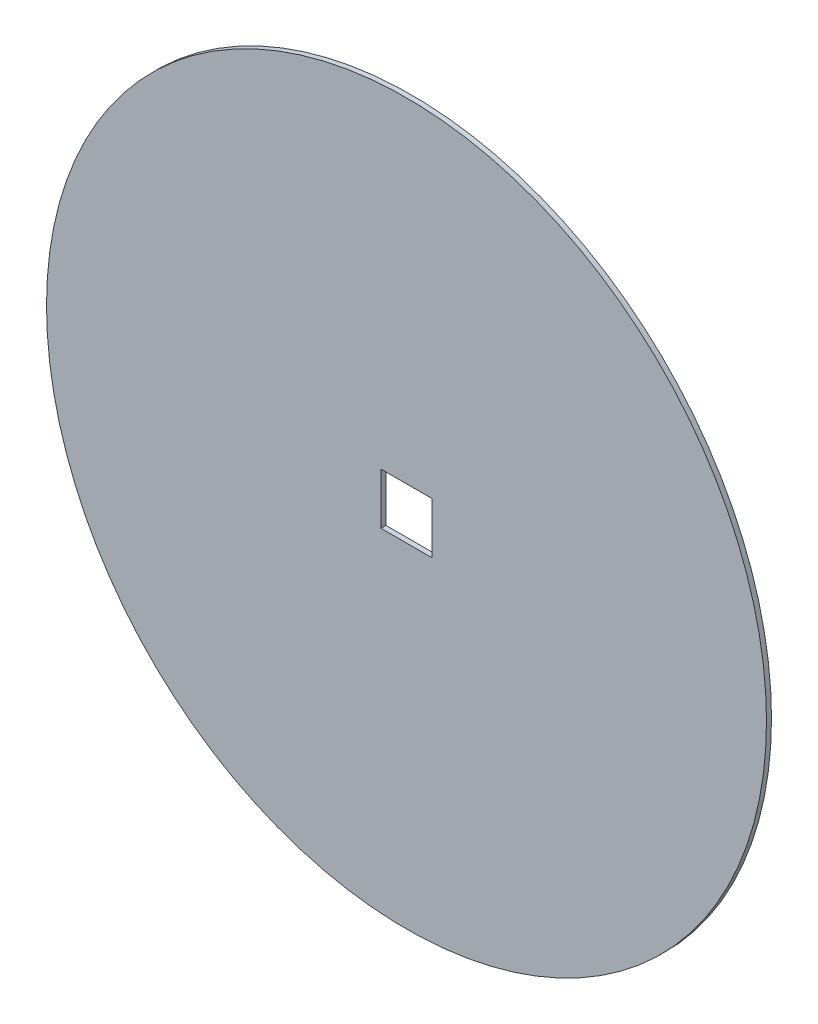
ISO-10303-21;
HEADER;
FILE_DESCRIPTION(('STEP AP214'),'2;1');
FILE_NAME('part.step','',(''),(''),'','','');
FILE_SCHEMA(('AUTOMOTIVE_DESIGN { 1 0 10303 214 1 1 1 1 }'));
ENDSEC;
DATA;
#1=APPLICATION_CONTEXT('core data for automotive mechanical design processes');
#2=APPLICATION_PROTOCOL_DEFINITION('international standard','automotive_design',2000,#1);
#3=PRODUCT_CONTEXT('',#1,'mechanical');
#4=PRODUCT('Part','Part','',(#3));
#5=PRODUCT_RELATED_PRODUCT_CATEGORY('part','',(#4));
#6=PRODUCT_DEFINITION_FORMATION('','',#4);
#7=PRODUCT_DEFINITION_CONTEXT('part definition',#1,'design');
#8=PRODUCT_DEFINITION('design','',#6,#7);
#9=PRODUCT_DEFINITION_SHAPE('','',#8);
#10=(LENGTH_UNIT() NAMED_UNIT(*) SI_UNIT(.MILLI.,.METRE.));
#11=(NAMED_UNIT(*) PLANE_ANGLE_UNIT() SI_UNIT($,.RADIAN.));
#12=(NAMED_UNIT(*) SI_UNIT($,.STERADIAN.) SOLID_ANGLE_UNIT());
#13=UNCERTAINTY_MEASURE_WITH_UNIT(LENGTH_MEASURE(1.E-05),#10,'distance_accuracy_value','');
#14=(GEOMETRIC_REPRESENTATION_CONTEXT(3) GLOBAL_UNCERTAINTY_ASSIGNED_CONTEXT((#13)) GLOBAL_UNIT_ASSIGNED_CONTEXT((#10,
#11,#12)) REPRESENTATION_CONTEXT('',''));
#15=CARTESIAN_POINT('',(0.,0.,0.));
#16=DIRECTION('',(0.,0.,1.));
#17=DIRECTION('',(1.,0.,0.));
#18=AXIS2_PLACEMENT_3D('',#15,#16,#17);
#19=CARTESIAN_POINT('',(0.,0.,2.));
#20=DIRECTION('',(0.,0.,1.));
#21=DIRECTION('',(1.,0.,0.));
#22=AXIS2_PLACEMENT_3D('',#19,#20,#21);
#23=PLANE('',#22);
#24=CARTESIAN_POINT('',(0.,0.,2.));
#25=DIRECTION('',(0.,0.,1.));
#26=DIRECTION('',(1.,0.,0.));
#27=AXIS2_PLACEMENT_3D('',#24,#25,#26);
#28=CIRCLE('',#27,144.);
#29=CARTESIAN_POINT('',(144.,0.,2.));
#30=VERTEX_POINT('',#29);
#31=EDGE_CURVE('E11',#30,#30,#28,.T.);
#32=ORIENTED_EDGE('',*,*,#31,.T.);
#33=EDGE_LOOP('',(#32));
#34=FACE_BOUND('',#33,.T.);
#35=DIRECTION('',(-1.,0.,0.));
#36=VECTOR('',#35,1.);
#37=CARTESIAN_POINT('',(-10.25,10.25,2.));
#38=LINE('',#37,#36);
#39=CARTESIAN_POINT('',(10.25,10.25,2.));
#40=VERTEX_POINT('',#39);
#41=CARTESIAN_POINT('',(-10.25,10.25,2.));
#42=VERTEX_POINT('',#41);
#43=EDGE_CURVE('E84',#40,#42,#38,.T.);
#44=ORIENTED_EDGE('',*,*,#43,.F.);
#45=DIRECTION('',(0.,1.,0.));
#46=VECTOR('',#45,1.);
#47=CARTESIAN_POINT('',(10.25,10.25,2.));
#48=LINE('',#47,#46);
#49=CARTESIAN_POINT('',(10.25,-10.25,2.));
#50=VERTEX_POINT('',#49);
#51=EDGE_CURVE('E76',#50,#40,#48,.T.);
#52=ORIENTED_EDGE('',*,*,#51,.F.);
#53=DIRECTION('',(1.,0.,0.));
#54=VECTOR('',#53,1.);
#55=CARTESIAN_POINT('',(-10.25,-10.25,2.));
#56=LINE('',#55,#54);
#57=CARTESIAN_POINT('',(-10.25,-10.25,2.));
#58=VERTEX_POINT('',#57);
#59=EDGE_CURVE('E97',#58,#50,#56,.T.);
#60=ORIENTED_EDGE('',*,*,#59,.F.);
#61=DIRECTION('',(0.,-1.,0.));
#62=VECTOR('',#61,1.);
#63=CARTESIAN_POINT('',(-10.25,10.25,2.));
#64=LINE('',#63,#62);
#65=EDGE_CURVE('E95',#42,#58,#64,.T.);
#66=ORIENTED_EDGE('',*,*,#65,.F.);
#67=EDGE_LOOP('',(#44,#52,#60,#66));
#68=FACE_BOUND('',#67,.T.);
#69=ADVANCED_FACE('F35',(#34,#68),#23,.T.);
#70=CARTESIAN_POINT('',(0.,0.,0.));
#71=DIRECTION('',(0.,0.,1.));
#72=DIRECTION('',(1.,0.,0.));
#73=AXIS2_PLACEMENT_3D('',#70,#71,#72);
#74=PLANE('',#73);
#75=CARTESIAN_POINT('',(0.,0.,0.));
#76=DIRECTION('',(0.,0.,1.));
#77=DIRECTION('',(1.,0.,0.));
#78=AXIS2_PLACEMENT_3D('',#75,#76,#77);
#79=CIRCLE('',#78,144.);
#80=CARTESIAN_POINT('',(144.,0.,0.));
#81=VERTEX_POINT('',#80);
#82=EDGE_CURVE('E39',#81,#81,#79,.T.);
#83=ORIENTED_EDGE('',*,*,#82,.F.);
#84=EDGE_LOOP('',(#83));
#85=FACE_BOUND('',#84,.T.);
#86=DIRECTION('',(0.,1.,0.));
#87=VECTOR('',#86,1.);
#88=CARTESIAN_POINT('',(10.25,10.25,0.));
#89=LINE('',#88,#87);
#90=CARTESIAN_POINT('',(10.25,-10.25,0.));
#91=VERTEX_POINT('',#90);
#92=CARTESIAN_POINT('',(10.25,10.25,0.));
#93=VERTEX_POINT('',#92);
#94=EDGE_CURVE('E58',#91,#93,#89,.T.);
#95=ORIENTED_EDGE('',*,*,#94,.T.);
#96=DIRECTION('',(-1.,0.,0.));
#97=VECTOR('',#96,1.);
#98=CARTESIAN_POINT('',(-10.25,10.25,0.));
#99=LINE('',#98,#97);
#100=CARTESIAN_POINT('',(-10.25,10.25,0.));
#101=VERTEX_POINT('',#100);
#102=EDGE_CURVE('E91',#93,#101,#99,.T.);
#103=ORIENTED_EDGE('',*,*,#102,.T.);
#104=DIRECTION('',(0.,-1.,0.));
#105=VECTOR('',#104,1.);
#106=CARTESIAN_POINT('',(-10.25,10.25,0.));
#107=LINE('',#106,#105);
#108=CARTESIAN_POINT('',(-10.25,-10.25,0.));
#109=VERTEX_POINT('',#108);
#110=EDGE_CURVE('E103',#101,#109,#107,.T.);
#111=ORIENTED_EDGE('',*,*,#110,.T.);
#112=DIRECTION('',(1.,0.,0.));
#113=VECTOR('',#112,1.);
#114=CARTESIAN_POINT('',(-10.25,-10.25,0.));
#115=LINE('',#114,#113);
#116=EDGE_CURVE('E85',#109,#91,#115,.T.);
#117=ORIENTED_EDGE('',*,*,#116,.T.);
#118=EDGE_LOOP('',(#95,#103,#111,#117));
#119=FACE_BOUND('',#118,.T.);
#120=ADVANCED_FACE('F114',(#85,#119),#74,.F.);
#121=CARTESIAN_POINT('',(0.,0.,2.));
#122=DIRECTION('',(0.,0.,-1.));
#123=DIRECTION('',(-1.,0.,0.));
#124=AXIS2_PLACEMENT_3D('',#121,#122,#123);
#125=CYLINDRICAL_SURFACE('',#124,144.);
#126=ORIENTED_EDGE('',*,*,#31,.F.);
#127=EDGE_LOOP('',(#126));
#128=FACE_BOUND('',#127,.T.);
#129=ORIENTED_EDGE('',*,*,#82,.T.);
#130=EDGE_LOOP('',(#129));
#131=FACE_BOUND('',#130,.T.);
#132=ADVANCED_FACE('F37',(#128,#131),#125,.T.);
#133=CARTESIAN_POINT('',(10.25,10.25,2.));
#134=DIRECTION('',(-1.,0.,0.));
#135=DIRECTION('',(0.,-1.,0.));
#136=AXIS2_PLACEMENT_3D('',#133,#134,#135);
#137=PLANE('',#136);
#138=ORIENTED_EDGE('',*,*,#94,.F.);
#139=DIRECTION('',(0.,0.,-1.));
#140=VECTOR('',#139,1.);
#141=CARTESIAN_POINT('',(10.25,-10.25,2.));
#142=LINE('',#141,#140);
#143=EDGE_CURVE('E80',#50,#91,#142,.T.);
#144=ORIENTED_EDGE('',*,*,#143,.F.);
#145=ORIENTED_EDGE('',*,*,#51,.T.);
#146=DIRECTION('',(0.,0.,-1.));
#147=VECTOR('',#146,1.);
#148=CARTESIAN_POINT('',(10.25,10.25,2.));
#149=LINE('',#148,#147);
#150=EDGE_CURVE('E79',#40,#93,#149,.T.);
#151=ORIENTED_EDGE('',*,*,#150,.T.);
#152=EDGE_LOOP('',(#138,#144,#145,#151));
#153=FACE_BOUND('',#152,.T.);
#154=ADVANCED_FACE('F78',(#153),#137,.T.);
#155=CARTESIAN_POINT('',(-10.25,10.25,2.));
#156=DIRECTION('',(0.,-1.,0.));
#157=DIRECTION('',(0.,0.,-1.));
#158=AXIS2_PLACEMENT_3D('',#155,#156,#157);
#159=PLANE('',#158);
#160=ORIENTED_EDGE('',*,*,#102,.F.);
#161=ORIENTED_EDGE('',*,*,#150,.F.);
#162=ORIENTED_EDGE('',*,*,#43,.T.);
#163=DIRECTION('',(0.,0.,-1.));
#164=VECTOR('',#163,1.);
#165=CARTESIAN_POINT('',(-10.25,10.25,2.));
#166=LINE('',#165,#164);
#167=EDGE_CURVE('E92',#42,#101,#166,.T.);
#168=ORIENTED_EDGE('',*,*,#167,.T.);
#169=EDGE_LOOP('',(#160,#161,#162,#168));
#170=FACE_BOUND('',#169,.T.);
#171=ADVANCED_FACE('F88',(#170),#159,.T.);
#172=CARTESIAN_POINT('',(-10.25,10.25,2.));
#173=DIRECTION('',(1.,0.,0.));
#174=DIRECTION('',(0.,0.,-1.));
#175=AXIS2_PLACEMENT_3D('',#172,#173,#174);
#176=PLANE('',#175);
#177=ORIENTED_EDGE('',*,*,#110,.F.);
#178=ORIENTED_EDGE('',*,*,#167,.F.);
#179=ORIENTED_EDGE('',*,*,#65,.T.);
#180=DIRECTION('',(0.,0.,-1.));
#181=VECTOR('',#180,1.);
#182=CARTESIAN_POINT('',(-10.25,-10.25,2.));
#183=LINE('',#182,#181);
#184=EDGE_CURVE('E50',#58,#109,#183,.T.);
#185=ORIENTED_EDGE('',*,*,#184,.T.);
#186=EDGE_LOOP('',(#177,#178,#179,#185));
#187=FACE_BOUND('',#186,.T.);
#188=ADVANCED_FACE('F112',(#187),#176,.T.);
#189=CARTESIAN_POINT('',(-10.25,-10.25,2.));
#190=DIRECTION('',(0.,1.,0.));
#191=DIRECTION('',(0.,0.,1.));
#192=AXIS2_PLACEMENT_3D('',#189,#190,#191);
#193=PLANE('',#192);
#194=ORIENTED_EDGE('',*,*,#116,.F.);
#195=ORIENTED_EDGE('',*,*,#184,.F.);
#196=ORIENTED_EDGE('',*,*,#59,.T.);
#197=ORIENTED_EDGE('',*,*,#143,.T.);
#198=EDGE_LOOP('',(#194,#195,#196,#197));
#199=FACE_BOUND('',#198,.T.);
#200=ADVANCED_FACE('F115',(#199),#193,.T.);
#201=CLOSED_SHELL('',(#69,#120,#132,#154,#171,#188,#200));
#202=MANIFOLD_SOLID_BREP('B2',#201);
#203=ADVANCED_BREP_SHAPE_REPRESENTATION('',(#18,#202),#14);
#204=SHAPE_DEFINITION_REPRESENTATION(#9,#203);
ENDSEC;
END-ISO-10303-21;
